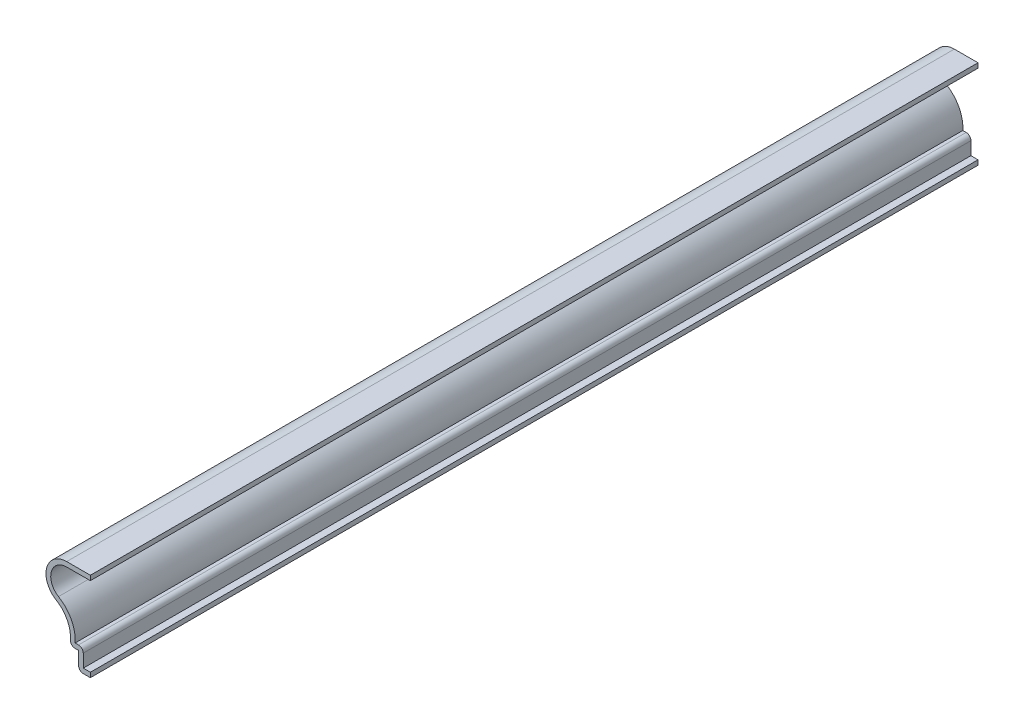
ISO-10303-21;
HEADER;
FILE_DESCRIPTION(('STEP AP214'),'2;1');
FILE_NAME('part.step','',(''),(''),'','','');
FILE_SCHEMA(('AUTOMOTIVE_DESIGN { 1 0 10303 214 1 1 1 1 }'));
ENDSEC;
DATA;
#1=APPLICATION_CONTEXT('core data for automotive mechanical design processes');
#2=APPLICATION_PROTOCOL_DEFINITION('international standard','automotive_design',2000,#1);
#3=PRODUCT_CONTEXT('',#1,'mechanical');
#4=PRODUCT('Part','Part','',(#3));
#5=PRODUCT_RELATED_PRODUCT_CATEGORY('part','',(#4));
#6=PRODUCT_DEFINITION_FORMATION('','',#4);
#7=PRODUCT_DEFINITION_CONTEXT('part definition',#1,'design');
#8=PRODUCT_DEFINITION('design','',#6,#7);
#9=PRODUCT_DEFINITION_SHAPE('','',#8);
#10=(LENGTH_UNIT() NAMED_UNIT(*) SI_UNIT(.MILLI.,.METRE.));
#11=(NAMED_UNIT(*) PLANE_ANGLE_UNIT() SI_UNIT($,.RADIAN.));
#12=(NAMED_UNIT(*) SI_UNIT($,.STERADIAN.) SOLID_ANGLE_UNIT());
#13=UNCERTAINTY_MEASURE_WITH_UNIT(LENGTH_MEASURE(1.E-05),#10,'distance_accuracy_value','');
#14=(GEOMETRIC_REPRESENTATION_CONTEXT(3) GLOBAL_UNCERTAINTY_ASSIGNED_CONTEXT((#13)) GLOBAL_UNIT_ASSIGNED_CONTEXT((#10,
#11,#12)) REPRESENTATION_CONTEXT('',''));
#15=CARTESIAN_POINT('',(0.,0.,0.));
#16=DIRECTION('',(0.,0.,1.));
#17=DIRECTION('',(1.,0.,0.));
#18=AXIS2_PLACEMENT_3D('',#15,#16,#17);
#19=CARTESIAN_POINT('',(-6.35,22.5425,-238.125));
#20=DIRECTION('',(0.,-1.,0.));
#21=DIRECTION('',(1.,0.,0.));
#22=AXIS2_PLACEMENT_3D('',#19,#20,#21);
#23=PLANE('',#22);
#24=DIRECTION('',(1.,0.,0.));
#25=VECTOR('',#24,1.);
#26=CARTESIAN_POINT('',(-6.35,22.5425,0.));
#27=LINE('',#26,#25);
#28=CARTESIAN_POINT('',(-6.35,22.5425,0.));
#29=VERTEX_POINT('',#28);
#30=CARTESIAN_POINT('',(0.,22.5425,0.));
#31=VERTEX_POINT('',#30);
#32=EDGE_CURVE('E233',#29,#31,#27,.T.);
#33=ORIENTED_EDGE('',*,*,#32,.F.);
#34=DIRECTION('',(0.,0.,1.));
#35=VECTOR('',#34,1.);
#36=CARTESIAN_POINT('',(-6.35,22.5425,-238.125));
#37=LINE('',#36,#35);
#38=CARTESIAN_POINT('',(-6.35,22.5425,-238.125));
#39=VERTEX_POINT('',#38);
#40=EDGE_CURVE('E187',#39,#29,#37,.T.);
#41=ORIENTED_EDGE('',*,*,#40,.F.);
#42=DIRECTION('',(1.,0.,0.));
#43=VECTOR('',#42,1.);
#44=CARTESIAN_POINT('',(-6.35,22.5425,-238.125));
#45=LINE('',#44,#43);
#46=CARTESIAN_POINT('',(0.,22.5425,-238.125));
#47=VERTEX_POINT('',#46);
#48=EDGE_CURVE('E166',#39,#47,#45,.T.);
#49=ORIENTED_EDGE('',*,*,#48,.T.);
#50=DIRECTION('',(0.,0.,1.));
#51=VECTOR('',#50,1.);
#52=CARTESIAN_POINT('',(0.,22.5425,-238.125));
#53=LINE('',#52,#51);
#54=EDGE_CURVE('E176',#47,#31,#53,.T.);
#55=ORIENTED_EDGE('',*,*,#54,.T.);
#56=EDGE_LOOP('',(#33,#41,#49,#55));
#57=FACE_BOUND('',#56,.T.);
#58=ADVANCED_FACE('F41',(#57),#23,.T.);
#59=CARTESIAN_POINT('',(-6.35,18.25625,-238.125));
#60=DIRECTION('',(0.,0.,1.));
#61=DIRECTION('',(1.,0.,0.));
#62=AXIS2_PLACEMENT_3D('',#59,#60,#61);
#63=CYLINDRICAL_SURFACE('',#62,4.28625);
#64=CARTESIAN_POINT('',(-6.35,18.25625,0.));
#65=DIRECTION('',(0.,0.,1.));
#66=DIRECTION('',(1.,0.,0.));
#67=AXIS2_PLACEMENT_3D('',#64,#65,#66);
#68=CIRCLE('',#67,4.28625);
#69=CARTESIAN_POINT('',(-8.54552892577021,14.5750013261658,0.));
#70=VERTEX_POINT('',#69);
#71=EDGE_CURVE('E189',#70,#29,#68,.F.);
#72=ORIENTED_EDGE('',*,*,#71,.F.);
#73=DIRECTION('',(0.,0.,1.));
#74=VECTOR('',#73,1.);
#75=CARTESIAN_POINT('',(-8.54552892577021,14.5750013261658,-238.125));
#76=LINE('',#75,#74);
#77=CARTESIAN_POINT('',(-8.54552892577021,14.5750013261658,-238.125));
#78=VERTEX_POINT('',#77);
#79=EDGE_CURVE('E277',#78,#70,#76,.T.);
#80=ORIENTED_EDGE('',*,*,#79,.F.);
#81=CARTESIAN_POINT('',(-6.35,18.25625,-238.125));
#82=DIRECTION('',(0.,0.,1.));
#83=DIRECTION('',(1.,0.,0.));
#84=AXIS2_PLACEMENT_3D('',#81,#82,#83);
#85=CIRCLE('',#84,4.28625);
#86=EDGE_CURVE('E185',#78,#39,#85,.F.);
#87=ORIENTED_EDGE('',*,*,#86,.T.);
#88=ORIENTED_EDGE('',*,*,#40,.T.);
#89=EDGE_LOOP('',(#72,#80,#87,#88));
#90=FACE_BOUND('',#89,.T.);
#91=ADVANCED_FACE('F360',(#90),#63,.F.);
#92=CARTESIAN_POINT('',(-13.2618503218692,6.66713380459593,-238.125));
#93=DIRECTION('',(0.,0.,1.));
#94=DIRECTION('',(1.,0.,0.));
#95=AXIS2_PLACEMENT_3D('',#92,#93,#94);
#96=CYLINDRICAL_SURFACE('',#95,9.2075);
#97=CARTESIAN_POINT('',(-13.2618503218692,6.66713380459593,0.));
#98=DIRECTION('',(0.,0.,1.));
#99=DIRECTION('',(1.,0.,0.));
#100=AXIS2_PLACEMENT_3D('',#97,#98,#99);
#101=CIRCLE('',#100,9.2075);
#102=CARTESIAN_POINT('',(-4.07624766422803,6.0325,0.));
#103=VERTEX_POINT('',#102);
#104=EDGE_CURVE('E193',#103,#70,#101,.T.);
#105=ORIENTED_EDGE('',*,*,#104,.F.);
#106=DIRECTION('',(0.,0.,1.));
#107=VECTOR('',#106,1.);
#108=CARTESIAN_POINT('',(-4.07624766422803,6.0325,-238.125));
#109=LINE('',#108,#107);
#110=CARTESIAN_POINT('',(-4.07624766422803,6.0325,-238.125));
#111=VERTEX_POINT('',#110);
#112=EDGE_CURVE('E280',#111,#103,#109,.T.);
#113=ORIENTED_EDGE('',*,*,#112,.F.);
#114=CARTESIAN_POINT('',(-13.2618503218692,6.66713380459593,-238.125));
#115=DIRECTION('',(0.,0.,1.));
#116=DIRECTION('',(1.,0.,0.));
#117=AXIS2_PLACEMENT_3D('',#114,#115,#116);
#118=CIRCLE('',#117,9.2075);
#119=EDGE_CURVE('E227',#111,#78,#118,.T.);
#120=ORIENTED_EDGE('',*,*,#119,.T.);
#121=ORIENTED_EDGE('',*,*,#79,.T.);
#122=EDGE_LOOP('',(#105,#113,#120,#121));
#123=FACE_BOUND('',#122,.T.);
#124=ADVANCED_FACE('F366',(#123),#96,.T.);
#125=CARTESIAN_POINT('',(-3.175,6.0325,-238.125));
#126=DIRECTION('',(0.,1.,0.));
#127=DIRECTION('',(-1.,0.,0.));
#128=AXIS2_PLACEMENT_3D('',#125,#126,#127);
#129=PLANE('',#128);
#130=DIRECTION('',(-1.,0.,0.));
#131=VECTOR('',#130,1.);
#132=CARTESIAN_POINT('',(-3.175,6.0325,0.));
#133=LINE('',#132,#131);
#134=CARTESIAN_POINT('',(-3.175,6.0325,0.));
#135=VERTEX_POINT('',#134);
#136=EDGE_CURVE('E268',#135,#103,#133,.T.);
#137=ORIENTED_EDGE('',*,*,#136,.F.);
#138=DIRECTION('',(0.,0.,1.));
#139=VECTOR('',#138,1.);
#140=CARTESIAN_POINT('',(-3.175,6.0325,-238.125));
#141=LINE('',#140,#139);
#142=CARTESIAN_POINT('',(-3.175,6.0325,-238.125));
#143=VERTEX_POINT('',#142);
#144=EDGE_CURVE('E335',#135,#143,#141,.F.);
#145=ORIENTED_EDGE('',*,*,#144,.T.);
#146=DIRECTION('',(-1.,0.,0.));
#147=VECTOR('',#146,1.);
#148=CARTESIAN_POINT('',(-3.175,6.0325,-238.125));
#149=LINE('',#148,#147);
#150=EDGE_CURVE('E224',#143,#111,#149,.T.);
#151=ORIENTED_EDGE('',*,*,#150,.T.);
#152=ORIENTED_EDGE('',*,*,#112,.T.);
#153=EDGE_LOOP('',(#137,#145,#151,#152));
#154=FACE_BOUND('',#153,.T.);
#155=ADVANCED_FACE('F369',(#154),#129,.T.);
#156=CARTESIAN_POINT('',(-1.905,0.,-238.125));
#157=DIRECTION('',(1.,0.,0.));
#158=DIRECTION('',(0.,0.,-1.));
#159=AXIS2_PLACEMENT_3D('',#156,#157,#158);
#160=PLANE('',#159);
#161=DIRECTION('',(0.,1.,0.));
#162=VECTOR('',#161,1.);
#163=CARTESIAN_POINT('',(-1.905,0.,-238.125));
#164=LINE('',#163,#162);
#165=CARTESIAN_POINT('',(-1.905,1.27,-238.125));
#166=VERTEX_POINT('',#165);
#167=CARTESIAN_POINT('',(-1.905,4.7625,-238.125));
#168=VERTEX_POINT('',#167);
#169=EDGE_CURVE('E220',#166,#168,#164,.T.);
#170=ORIENTED_EDGE('',*,*,#169,.T.);
#171=DIRECTION('',(0.,0.,1.));
#172=VECTOR('',#171,1.);
#173=CARTESIAN_POINT('',(-1.905,4.7625,-238.125));
#174=LINE('',#173,#172);
#175=CARTESIAN_POINT('',(-1.905,4.7625,0.));
#176=VERTEX_POINT('',#175);
#177=EDGE_CURVE('E331',#168,#176,#174,.T.);
#178=ORIENTED_EDGE('',*,*,#177,.T.);
#179=DIRECTION('',(0.,1.,0.));
#180=VECTOR('',#179,1.);
#181=CARTESIAN_POINT('',(-1.905,0.,0.));
#182=LINE('',#181,#180);
#183=CARTESIAN_POINT('',(-1.905,1.27,0.));
#184=VERTEX_POINT('',#183);
#185=EDGE_CURVE('E264',#184,#176,#182,.T.);
#186=ORIENTED_EDGE('',*,*,#185,.F.);
#187=DIRECTION('',(0.,0.,1.));
#188=VECTOR('',#187,1.);
#189=CARTESIAN_POINT('',(-1.905,1.27,-238.125));
#190=LINE('',#189,#188);
#191=EDGE_CURVE('E284',#166,#184,#190,.T.);
#192=ORIENTED_EDGE('',*,*,#191,.F.);
#193=EDGE_LOOP('',(#170,#178,#186,#192));
#194=FACE_BOUND('',#193,.T.);
#195=ADVANCED_FACE('F377',(#194),#160,.T.);
#196=CARTESIAN_POINT('',(0.,1.27,-238.125));
#197=DIRECTION('',(0.,1.,0.));
#198=DIRECTION('',(0.,0.,1.));
#199=AXIS2_PLACEMENT_3D('',#196,#197,#198);
#200=PLANE('',#199);
#201=DIRECTION('',(1.,0.,0.));
#202=VECTOR('',#201,1.);
#203=CARTESIAN_POINT('',(0.,1.27,0.));
#204=LINE('',#203,#202);
#205=CARTESIAN_POINT('',(0.,1.27,0.));
#206=VERTEX_POINT('',#205);
#207=EDGE_CURVE('E260',#206,#184,#204,.F.);
#208=ORIENTED_EDGE('',*,*,#207,.F.);
#209=DIRECTION('',(0.,0.,1.));
#210=VECTOR('',#209,1.);
#211=CARTESIAN_POINT('',(0.,1.27,-238.125));
#212=LINE('',#211,#210);
#213=CARTESIAN_POINT('',(0.,1.27,-238.125));
#214=VERTEX_POINT('',#213);
#215=EDGE_CURVE('E287',#214,#206,#212,.T.);
#216=ORIENTED_EDGE('',*,*,#215,.F.);
#217=DIRECTION('',(1.,0.,0.));
#218=VECTOR('',#217,1.);
#219=CARTESIAN_POINT('',(0.,1.27,-238.125));
#220=LINE('',#219,#218);
#221=EDGE_CURVE('E216',#214,#166,#220,.F.);
#222=ORIENTED_EDGE('',*,*,#221,.T.);
#223=ORIENTED_EDGE('',*,*,#191,.T.);
#224=EDGE_LOOP('',(#208,#216,#222,#223));
#225=FACE_BOUND('',#224,.T.);
#226=ADVANCED_FACE('F381',(#225),#200,.T.);
#227=CARTESIAN_POINT('',(0.,1.27,-238.125));
#228=DIRECTION('',(-1.,0.,0.));
#229=DIRECTION('',(0.,0.,1.));
#230=AXIS2_PLACEMENT_3D('',#227,#228,#229);
#231=PLANE('',#230);
#232=DIRECTION('',(0.,-1.,0.));
#233=VECTOR('',#232,1.);
#234=CARTESIAN_POINT('',(0.,1.27,0.));
#235=LINE('',#234,#233);
#236=CARTESIAN_POINT('',(0.,0.,0.));
#237=VERTEX_POINT('',#236);
#238=EDGE_CURVE('E257',#206,#237,#235,.T.);
#239=ORIENTED_EDGE('',*,*,#238,.T.);
#240=DIRECTION('',(0.,0.,1.));
#241=VECTOR('',#240,1.);
#242=CARTESIAN_POINT('',(0.,0.,-238.125));
#243=LINE('',#242,#241);
#244=CARTESIAN_POINT('',(0.,0.,-238.125));
#245=VERTEX_POINT('',#244);
#246=EDGE_CURVE('E290',#245,#237,#243,.T.);
#247=ORIENTED_EDGE('',*,*,#246,.F.);
#248=DIRECTION('',(0.,-1.,0.));
#249=VECTOR('',#248,1.);
#250=CARTESIAN_POINT('',(0.,1.27,-238.125));
#251=LINE('',#250,#249);
#252=EDGE_CURVE('E213',#214,#245,#251,.T.);
#253=ORIENTED_EDGE('',*,*,#252,.F.);
#254=ORIENTED_EDGE('',*,*,#215,.T.);
#255=EDGE_LOOP('',(#239,#247,#253,#254));
#256=FACE_BOUND('',#255,.T.);
#257=ADVANCED_FACE('F387',(#256),#231,.F.);
#258=CARTESIAN_POINT('',(0.,0.,-238.125));
#259=DIRECTION('',(0.,1.,0.));
#260=DIRECTION('',(0.,0.,1.));
#261=AXIS2_PLACEMENT_3D('',#258,#259,#260);
#262=PLANE('',#261);
#263=DIRECTION('',(-1.,0.,0.));
#264=VECTOR('',#263,1.);
#265=CARTESIAN_POINT('',(0.,0.,0.));
#266=LINE('',#265,#264);
#267=CARTESIAN_POINT('',(-1.905,0.,0.));
#268=VERTEX_POINT('',#267);
#269=EDGE_CURVE('E253',#237,#268,#266,.T.);
#270=ORIENTED_EDGE('',*,*,#269,.T.);
#271=DIRECTION('',(0.,0.,1.));
#272=VECTOR('',#271,1.);
#273=CARTESIAN_POINT('',(-1.905,0.,-238.125));
#274=LINE('',#273,#272);
#275=CARTESIAN_POINT('',(-1.905,0.,-238.125));
#276=VERTEX_POINT('',#275);
#277=EDGE_CURVE('E320',#268,#276,#274,.F.);
#278=ORIENTED_EDGE('',*,*,#277,.T.);
#279=DIRECTION('',(-1.,0.,0.));
#280=VECTOR('',#279,1.);
#281=CARTESIAN_POINT('',(0.,0.,-238.125));
#282=LINE('',#281,#280);
#283=EDGE_CURVE('E210',#245,#276,#282,.T.);
#284=ORIENTED_EDGE('',*,*,#283,.F.);
#285=ORIENTED_EDGE('',*,*,#246,.T.);
#286=EDGE_LOOP('',(#270,#278,#284,#285));
#287=FACE_BOUND('',#286,.T.);
#288=ADVANCED_FACE('F391',(#287),#262,.F.);
#289=CARTESIAN_POINT('',(-3.175,0.,-238.125));
#290=DIRECTION('',(1.,0.,0.));
#291=DIRECTION('',(0.,0.,-1.));
#292=AXIS2_PLACEMENT_3D('',#289,#290,#291);
#293=PLANE('',#292);
#294=DIRECTION('',(0.,1.,0.));
#295=VECTOR('',#294,1.);
#296=CARTESIAN_POINT('',(-3.175,0.,-238.125));
#297=LINE('',#296,#295);
#298=CARTESIAN_POINT('',(-3.175,1.27,-238.125));
#299=VERTEX_POINT('',#298);
#300=CARTESIAN_POINT('',(-3.175,4.7625,-238.125));
#301=VERTEX_POINT('',#300);
#302=EDGE_CURVE('E207',#299,#301,#297,.T.);
#303=ORIENTED_EDGE('',*,*,#302,.F.);
#304=DIRECTION('',(0.,0.,1.));
#305=VECTOR('',#304,1.);
#306=CARTESIAN_POINT('',(-3.175,1.27,-238.125));
#307=LINE('',#306,#305);
#308=CARTESIAN_POINT('',(-3.175,1.27,0.));
#309=VERTEX_POINT('',#308);
#310=EDGE_CURVE('E276',#299,#309,#307,.T.);
#311=ORIENTED_EDGE('',*,*,#310,.T.);
#312=DIRECTION('',(0.,1.,0.));
#313=VECTOR('',#312,1.);
#314=CARTESIAN_POINT('',(-3.175,0.,0.));
#315=LINE('',#314,#313);
#316=CARTESIAN_POINT('',(-3.175,4.7625,0.));
#317=VERTEX_POINT('',#316);
#318=EDGE_CURVE('E250',#309,#317,#315,.T.);
#319=ORIENTED_EDGE('',*,*,#318,.T.);
#320=DIRECTION('',(0.,0.,1.));
#321=VECTOR('',#320,1.);
#322=CARTESIAN_POINT('',(-3.175,4.7625,-238.125));
#323=LINE('',#322,#321);
#324=EDGE_CURVE('E294',#301,#317,#323,.T.);
#325=ORIENTED_EDGE('',*,*,#324,.F.);
#326=EDGE_LOOP('',(#303,#311,#319,#325));
#327=FACE_BOUND('',#326,.T.);
#328=ADVANCED_FACE('F399',(#327),#293,.F.);
#329=CARTESIAN_POINT('',(-3.175,4.7625,-238.125));
#330=DIRECTION('',(0.,1.,0.));
#331=DIRECTION('',(-1.,0.,0.));
#332=AXIS2_PLACEMENT_3D('',#329,#330,#331);
#333=PLANE('',#332);
#334=DIRECTION('',(-1.,0.,0.));
#335=VECTOR('',#334,1.);
#336=CARTESIAN_POINT('',(-3.175,4.7625,0.));
#337=LINE('',#336,#335);
#338=CARTESIAN_POINT('',(-4.07624766422803,4.7625,0.));
#339=VERTEX_POINT('',#338);
#340=EDGE_CURVE('E247',#317,#339,#337,.T.);
#341=ORIENTED_EDGE('',*,*,#340,.T.);
#342=DIRECTION('',(0.,0.,1.));
#343=VECTOR('',#342,1.);
#344=CARTESIAN_POINT('',(-4.07624766422803,4.7625,-238.125));
#345=LINE('',#344,#343);
#346=CARTESIAN_POINT('',(-4.07624766422803,4.7625,-238.125));
#347=VERTEX_POINT('',#346);
#348=EDGE_CURVE('E11',#339,#347,#345,.F.);
#349=ORIENTED_EDGE('',*,*,#348,.T.);
#350=DIRECTION('',(-1.,0.,0.));
#351=VECTOR('',#350,1.);
#352=CARTESIAN_POINT('',(-3.175,4.7625,-238.125));
#353=LINE('',#352,#351);
#354=EDGE_CURVE('E204',#301,#347,#353,.T.);
#355=ORIENTED_EDGE('',*,*,#354,.F.);
#356=ORIENTED_EDGE('',*,*,#324,.T.);
#357=EDGE_LOOP('',(#341,#349,#355,#356));
#358=FACE_BOUND('',#357,.T.);
#359=ADVANCED_FACE('F400',(#358),#333,.F.);
#360=CARTESIAN_POINT('',(-13.2618503218692,6.66713380459593,-238.125));
#361=DIRECTION('',(0.,0.,1.));
#362=DIRECTION('',(1.,0.,0.));
#363=AXIS2_PLACEMENT_3D('',#360,#361,#362);
#364=CYLINDRICAL_SURFACE('',#363,7.9375);
#365=CARTESIAN_POINT('',(-13.2618503218692,6.66713380459593,-238.125));
#366=DIRECTION('',(0.,0.,1.));
#367=DIRECTION('',(1.,0.,0.));
#368=AXIS2_PLACEMENT_3D('',#365,#366,#367);
#369=CIRCLE('',#368,7.9375);
#370=CARTESIAN_POINT('',(-5.34322734114405,6.12003569718565,-238.125));
#371=VERTEX_POINT('',#370);
#372=CARTESIAN_POINT('',(-9.19605601488731,13.484260978363,-238.125));
#373=VERTEX_POINT('',#372);
#374=EDGE_CURVE('E201',#371,#373,#369,.T.);
#375=ORIENTED_EDGE('',*,*,#374,.F.);
#376=DIRECTION('',(0.,0.,1.));
#377=VECTOR('',#376,1.);
#378=CARTESIAN_POINT('',(-5.34322734114405,6.12003569718565,-238.125));
#379=LINE('',#378,#377);
#380=CARTESIAN_POINT('',(-5.34322734114405,6.12003569718565,0.));
#381=VERTEX_POINT('',#380);
#382=EDGE_CURVE('E50',#371,#381,#379,.T.);
#383=ORIENTED_EDGE('',*,*,#382,.T.);
#384=CARTESIAN_POINT('',(-13.2618503218692,6.66713380459593,0.));
#385=DIRECTION('',(0.,0.,1.));
#386=DIRECTION('',(1.,0.,0.));
#387=AXIS2_PLACEMENT_3D('',#384,#385,#386);
#388=CIRCLE('',#387,7.9375);
#389=CARTESIAN_POINT('',(-9.19605601488731,13.484260978363,0.));
#390=VERTEX_POINT('',#389);
#391=EDGE_CURVE('E244',#381,#390,#388,.T.);
#392=ORIENTED_EDGE('',*,*,#391,.T.);
#393=DIRECTION('',(0.,0.,1.));
#394=VECTOR('',#393,1.);
#395=CARTESIAN_POINT('',(-9.19605601488731,13.484260978363,-238.125));
#396=LINE('',#395,#394);
#397=EDGE_CURVE('E298',#373,#390,#396,.T.);
#398=ORIENTED_EDGE('',*,*,#397,.F.);
#399=EDGE_LOOP('',(#375,#383,#392,#398));
#400=FACE_BOUND('',#399,.T.);
#401=ADVANCED_FACE('F342',(#400),#364,.F.);
#402=CARTESIAN_POINT('',(-6.35,18.25625,-238.125));
#403=DIRECTION('',(0.,0.,1.));
#404=DIRECTION('',(1.,0.,0.));
#405=AXIS2_PLACEMENT_3D('',#402,#403,#404);
#406=CYLINDRICAL_SURFACE('',#405,5.55625);
#407=CARTESIAN_POINT('',(-6.35,18.25625,0.));
#408=DIRECTION('',(0.,0.,-1.));
#409=DIRECTION('',(-1.,0.,0.));
#410=AXIS2_PLACEMENT_3D('',#407,#408,#409);
#411=CIRCLE('',#410,5.55625);
#412=CARTESIAN_POINT('',(-6.35,23.8125,0.));
#413=VERTEX_POINT('',#412);
#414=EDGE_CURVE('E241',#390,#413,#411,.T.);
#415=ORIENTED_EDGE('',*,*,#414,.T.);
#416=DIRECTION('',(0.,0.,1.));
#417=VECTOR('',#416,1.);
#418=CARTESIAN_POINT('',(-6.35,23.8125,-238.125));
#419=LINE('',#418,#417);
#420=CARTESIAN_POINT('',(-6.35,23.8125,-238.125));
#421=VERTEX_POINT('',#420);
#422=EDGE_CURVE('E302',#421,#413,#419,.T.);
#423=ORIENTED_EDGE('',*,*,#422,.F.);
#424=CARTESIAN_POINT('',(-6.35,18.25625,-238.125));
#425=DIRECTION('',(0.,0.,-1.));
#426=DIRECTION('',(-1.,0.,0.));
#427=AXIS2_PLACEMENT_3D('',#424,#425,#426);
#428=CIRCLE('',#427,5.55625);
#429=EDGE_CURVE('E198',#373,#421,#428,.T.);
#430=ORIENTED_EDGE('',*,*,#429,.F.);
#431=ORIENTED_EDGE('',*,*,#397,.T.);
#432=EDGE_LOOP('',(#415,#423,#430,#431));
#433=FACE_BOUND('',#432,.T.);
#434=ADVANCED_FACE('F353',(#433),#406,.T.);
#435=CARTESIAN_POINT('',(-6.35,23.8125,-238.125));
#436=DIRECTION('',(0.,-1.,0.));
#437=DIRECTION('',(1.,0.,0.));
#438=AXIS2_PLACEMENT_3D('',#435,#436,#437);
#439=PLANE('',#438);
#440=DIRECTION('',(1.,0.,0.));
#441=VECTOR('',#440,1.);
#442=CARTESIAN_POINT('',(-6.35,23.8125,0.));
#443=LINE('',#442,#441);
#444=CARTESIAN_POINT('',(0.,23.8125,0.));
#445=VERTEX_POINT('',#444);
#446=EDGE_CURVE('E238',#413,#445,#443,.T.);
#447=ORIENTED_EDGE('',*,*,#446,.T.);
#448=DIRECTION('',(0.,0.,1.));
#449=VECTOR('',#448,1.);
#450=CARTESIAN_POINT('',(0.,23.8125,-238.125));
#451=LINE('',#450,#449);
#452=CARTESIAN_POINT('',(0.,23.8125,-238.125));
#453=VERTEX_POINT('',#452);
#454=EDGE_CURVE('E184',#453,#445,#451,.T.);
#455=ORIENTED_EDGE('',*,*,#454,.F.);
#456=DIRECTION('',(1.,0.,0.));
#457=VECTOR('',#456,1.);
#458=CARTESIAN_POINT('',(-6.35,23.8125,-238.125));
#459=LINE('',#458,#457);
#460=EDGE_CURVE('E169',#421,#453,#459,.T.);
#461=ORIENTED_EDGE('',*,*,#460,.F.);
#462=ORIENTED_EDGE('',*,*,#422,.T.);
#463=EDGE_LOOP('',(#447,#455,#461,#462));
#464=FACE_BOUND('',#463,.T.);
#465=ADVANCED_FACE('F356',(#464),#439,.F.);
#466=CARTESIAN_POINT('',(0.,23.8125,-238.125));
#467=DIRECTION('',(-1.,0.,0.));
#468=DIRECTION('',(0.,-1.,0.));
#469=AXIS2_PLACEMENT_3D('',#466,#467,#468);
#470=PLANE('',#469);
#471=DIRECTION('',(0.,-1.,0.));
#472=VECTOR('',#471,1.);
#473=CARTESIAN_POINT('',(0.,23.8125,0.));
#474=LINE('',#473,#472);
#475=EDGE_CURVE('E179',#445,#31,#474,.T.);
#476=ORIENTED_EDGE('',*,*,#475,.T.);
#477=ORIENTED_EDGE('',*,*,#54,.F.);
#478=DIRECTION('',(0.,-1.,0.));
#479=VECTOR('',#478,1.);
#480=CARTESIAN_POINT('',(0.,23.8125,-238.125));
#481=LINE('',#480,#479);
#482=EDGE_CURVE('E160',#453,#47,#481,.T.);
#483=ORIENTED_EDGE('',*,*,#482,.F.);
#484=ORIENTED_EDGE('',*,*,#454,.T.);
#485=EDGE_LOOP('',(#476,#477,#483,#484));
#486=FACE_BOUND('',#485,.T.);
#487=ADVANCED_FACE('F177',(#486),#470,.F.);
#488=CARTESIAN_POINT('',(-6.35,18.25625,-238.125));
#489=DIRECTION('',(0.,0.,-1.));
#490=DIRECTION('',(-1.,0.,0.));
#491=AXIS2_PLACEMENT_3D('',#488,#489,#490);
#492=PLANE('',#491);
#493=ORIENTED_EDGE('',*,*,#283,.T.);
#494=CARTESIAN_POINT('',(-1.905,1.27,-238.125));
#495=DIRECTION('',(0.,0.,-1.));
#496=DIRECTION('',(-1.,0.,0.));
#497=AXIS2_PLACEMENT_3D('',#494,#495,#496);
#498=CIRCLE('',#497,1.27);
#499=EDGE_CURVE('E328',#276,#299,#498,.T.);
#500=ORIENTED_EDGE('',*,*,#499,.T.);
#501=ORIENTED_EDGE('',*,*,#302,.T.);
#502=ORIENTED_EDGE('',*,*,#354,.T.);
#503=CARTESIAN_POINT('',(-4.07624766422803,6.0325,-238.125));
#504=DIRECTION('',(0.,0.,-1.));
#505=DIRECTION('',(-1.,0.,0.));
#506=AXIS2_PLACEMENT_3D('',#503,#504,#505);
#507=CIRCLE('',#506,1.27);
#508=EDGE_CURVE('E57',#347,#371,#507,.T.);
#509=ORIENTED_EDGE('',*,*,#508,.T.);
#510=ORIENTED_EDGE('',*,*,#374,.T.);
#511=ORIENTED_EDGE('',*,*,#429,.T.);
#512=ORIENTED_EDGE('',*,*,#460,.T.);
#513=ORIENTED_EDGE('',*,*,#482,.T.);
#514=ORIENTED_EDGE('',*,*,#48,.F.);
#515=ORIENTED_EDGE('',*,*,#86,.F.);
#516=ORIENTED_EDGE('',*,*,#119,.F.);
#517=ORIENTED_EDGE('',*,*,#150,.F.);
#518=CARTESIAN_POINT('',(-3.175,4.7625,-238.125));
#519=DIRECTION('',(0.,0.,-1.));
#520=DIRECTION('',(-1.,0.,0.));
#521=AXIS2_PLACEMENT_3D('',#518,#519,#520);
#522=CIRCLE('',#521,1.27);
#523=EDGE_CURVE('E325',#143,#168,#522,.T.);
#524=ORIENTED_EDGE('',*,*,#523,.T.);
#525=ORIENTED_EDGE('',*,*,#169,.F.);
#526=ORIENTED_EDGE('',*,*,#221,.F.);
#527=ORIENTED_EDGE('',*,*,#252,.T.);
#528=EDGE_LOOP('',(#493,#500,#501,#502,#509,#510,#511,#512,#513,#514,#515,#516,#517,#524,#525,
#526,#527));
#529=FACE_BOUND('',#528,.T.);
#530=ADVANCED_FACE('F163',(#529),#492,.T.);
#531=CARTESIAN_POINT('',(-6.35,18.25625,0.));
#532=DIRECTION('',(0.,0.,-1.));
#533=DIRECTION('',(-1.,0.,0.));
#534=AXIS2_PLACEMENT_3D('',#531,#532,#533);
#535=PLANE('',#534);
#536=ORIENTED_EDGE('',*,*,#318,.F.);
#537=CARTESIAN_POINT('',(-1.905,1.27,0.));
#538=DIRECTION('',(0.,0.,-1.));
#539=DIRECTION('',(-1.,0.,0.));
#540=AXIS2_PLACEMENT_3D('',#537,#538,#539);
#541=CIRCLE('',#540,1.27);
#542=EDGE_CURVE('E317',#309,#268,#541,.F.);
#543=ORIENTED_EDGE('',*,*,#542,.T.);
#544=ORIENTED_EDGE('',*,*,#269,.F.);
#545=ORIENTED_EDGE('',*,*,#238,.F.);
#546=ORIENTED_EDGE('',*,*,#207,.T.);
#547=ORIENTED_EDGE('',*,*,#185,.T.);
#548=CARTESIAN_POINT('',(-3.175,4.7625,0.));
#549=DIRECTION('',(0.,0.,-1.));
#550=DIRECTION('',(-1.,0.,0.));
#551=AXIS2_PLACEMENT_3D('',#548,#549,#550);
#552=CIRCLE('',#551,1.27);
#553=EDGE_CURVE('E314',#176,#135,#552,.F.);
#554=ORIENTED_EDGE('',*,*,#553,.T.);
#555=ORIENTED_EDGE('',*,*,#136,.T.);
#556=ORIENTED_EDGE('',*,*,#104,.T.);
#557=ORIENTED_EDGE('',*,*,#71,.T.);
#558=ORIENTED_EDGE('',*,*,#32,.T.);
#559=ORIENTED_EDGE('',*,*,#475,.F.);
#560=ORIENTED_EDGE('',*,*,#446,.F.);
#561=ORIENTED_EDGE('',*,*,#414,.F.);
#562=ORIENTED_EDGE('',*,*,#391,.F.);
#563=CARTESIAN_POINT('',(-4.07624766422803,6.0325,0.));
#564=DIRECTION('',(0.,0.,-1.));
#565=DIRECTION('',(-1.,0.,0.));
#566=AXIS2_PLACEMENT_3D('',#563,#564,#565);
#567=CIRCLE('',#566,1.27);
#568=EDGE_CURVE('E311',#381,#339,#567,.F.);
#569=ORIENTED_EDGE('',*,*,#568,.T.);
#570=ORIENTED_EDGE('',*,*,#340,.F.);
#571=EDGE_LOOP('',(#536,#543,#544,#545,#546,#547,#554,#555,#556,#557,#558,#559,#560,#561,#562,
#569,#570));
#572=FACE_BOUND('',#571,.T.);
#573=ADVANCED_FACE('F348',(#572),#535,.F.);
#574=CARTESIAN_POINT('',(-1.905,1.27,-238.125));
#575=DIRECTION('',(0.,0.,1.));
#576=DIRECTION('',(1.,0.,0.));
#577=AXIS2_PLACEMENT_3D('',#574,#575,#576);
#578=CYLINDRICAL_SURFACE('',#577,1.27);
#579=ORIENTED_EDGE('',*,*,#499,.F.);
#580=ORIENTED_EDGE('',*,*,#277,.F.);
#581=ORIENTED_EDGE('',*,*,#542,.F.);
#582=ORIENTED_EDGE('',*,*,#310,.F.);
#583=EDGE_LOOP('',(#579,#580,#581,#582));
#584=FACE_BOUND('',#583,.T.);
#585=ADVANCED_FACE('F394',(#584),#578,.T.);
#586=CARTESIAN_POINT('',(-3.175,4.7625,-238.125));
#587=DIRECTION('',(0.,0.,1.));
#588=DIRECTION('',(1.,0.,0.));
#589=AXIS2_PLACEMENT_3D('',#586,#587,#588);
#590=CYLINDRICAL_SURFACE('',#589,1.27);
#591=ORIENTED_EDGE('',*,*,#523,.F.);
#592=ORIENTED_EDGE('',*,*,#144,.F.);
#593=ORIENTED_EDGE('',*,*,#553,.F.);
#594=ORIENTED_EDGE('',*,*,#177,.F.);
#595=EDGE_LOOP('',(#591,#592,#593,#594));
#596=FACE_BOUND('',#595,.T.);
#597=ADVANCED_FACE('F372',(#596),#590,.T.);
#598=CARTESIAN_POINT('',(-4.07624766422803,6.0325,-238.125));
#599=DIRECTION('',(0.,0.,1.));
#600=DIRECTION('',(1.,0.,0.));
#601=AXIS2_PLACEMENT_3D('',#598,#599,#600);
#602=CYLINDRICAL_SURFACE('',#601,1.27);
#603=ORIENTED_EDGE('',*,*,#508,.F.);
#604=ORIENTED_EDGE('',*,*,#348,.F.);
#605=ORIENTED_EDGE('',*,*,#568,.F.);
#606=ORIENTED_EDGE('',*,*,#382,.F.);
#607=EDGE_LOOP('',(#603,#604,#605,#606));
#608=FACE_BOUND('',#607,.T.);
#609=ADVANCED_FACE('F43',(#608),#602,.T.);
#610=CLOSED_SHELL('',(#58,#91,#124,#155,#195,#226,#257,#288,#328,#359,#401,#434,#465,#487,#530,
#573,#585,#597,#609));
#611=MANIFOLD_SOLID_BREP('B2',#610);
#612=ADVANCED_BREP_SHAPE_REPRESENTATION('',(#18,#611),#14);
#613=SHAPE_DEFINITION_REPRESENTATION(#9,#612);
ENDSEC;
END-ISO-10303-21;
